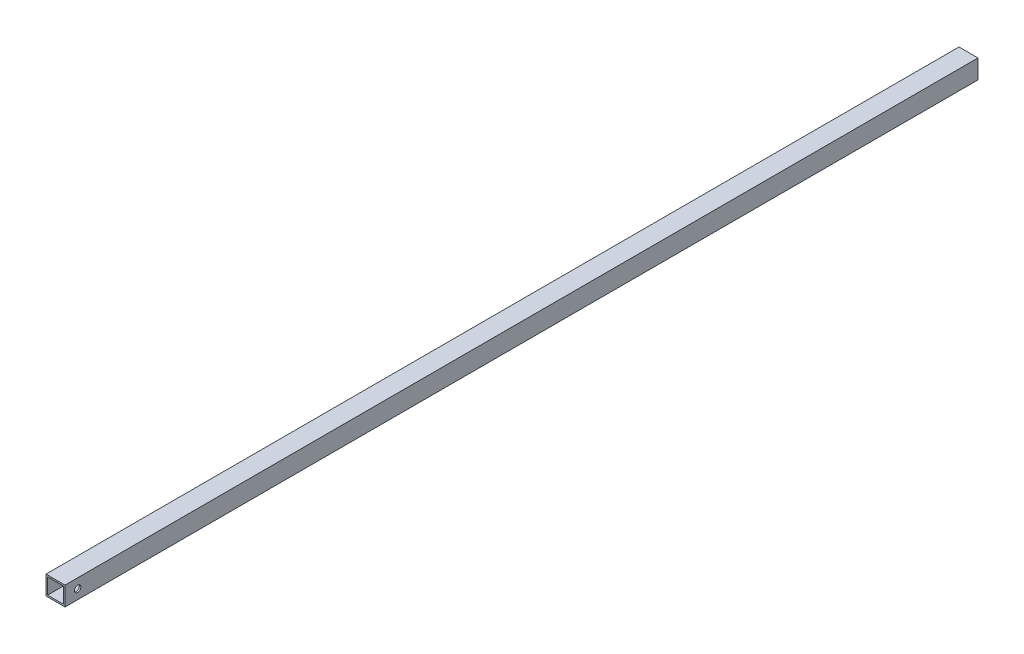
ISO-10303-21;
HEADER;
FILE_DESCRIPTION(('STEP AP214'),'2;1');
FILE_NAME('part.step','',(''),(''),'','','');
FILE_SCHEMA(('AUTOMOTIVE_DESIGN { 1 0 10303 214 1 1 1 1 }'));
ENDSEC;
DATA;
#1=APPLICATION_CONTEXT('core data for automotive mechanical design processes');
#2=APPLICATION_PROTOCOL_DEFINITION('international standard','automotive_design',2000,#1);
#3=PRODUCT_CONTEXT('',#1,'mechanical');
#4=PRODUCT('Part','Part','',(#3));
#5=PRODUCT_RELATED_PRODUCT_CATEGORY('part','',(#4));
#6=PRODUCT_DEFINITION_FORMATION('','',#4);
#7=PRODUCT_DEFINITION_CONTEXT('part definition',#1,'design');
#8=PRODUCT_DEFINITION('design','',#6,#7);
#9=PRODUCT_DEFINITION_SHAPE('','',#8);
#10=(LENGTH_UNIT() NAMED_UNIT(*) SI_UNIT(.MILLI.,.METRE.));
#11=(NAMED_UNIT(*) PLANE_ANGLE_UNIT() SI_UNIT($,.RADIAN.));
#12=(NAMED_UNIT(*) SI_UNIT($,.STERADIAN.) SOLID_ANGLE_UNIT());
#13=UNCERTAINTY_MEASURE_WITH_UNIT(LENGTH_MEASURE(1.E-05),#10,'distance_accuracy_value','');
#14=(GEOMETRIC_REPRESENTATION_CONTEXT(3) GLOBAL_UNCERTAINTY_ASSIGNED_CONTEXT((#13)) GLOBAL_UNIT_ASSIGNED_CONTEXT((#10,
#11,#12)) REPRESENTATION_CONTEXT('',''));
#15=CARTESIAN_POINT('',(0.,0.,0.));
#16=DIRECTION('',(0.,0.,1.));
#17=DIRECTION('',(1.,0.,0.));
#18=AXIS2_PLACEMENT_3D('',#15,#16,#17);
#19=CARTESIAN_POINT('',(19.05,19.05,-1828.8));
#20=DIRECTION('',(1.,0.,0.));
#21=DIRECTION('',(0.,1.,0.));
#22=AXIS2_PLACEMENT_3D('',#19,#20,#21);
#23=PLANE('',#22);
#24=CARTESIAN_POINT('',(19.05,0.,-25.4));
#25=DIRECTION('',(1.,0.,0.));
#26=DIRECTION('',(0.,1.,0.));
#27=AXIS2_PLACEMENT_3D('',#24,#25,#26);
#28=CIRCLE('',#27,6.35);
#29=CARTESIAN_POINT('',(19.05,6.35,-25.4));
#30=VERTEX_POINT('',#29);
#31=EDGE_CURVE('E196',#30,#30,#28,.F.);
#32=ORIENTED_EDGE('',*,*,#31,.T.);
#33=EDGE_LOOP('',(#32));
#34=FACE_BOUND('',#33,.T.);
#35=DIRECTION('',(0.,1.,0.));
#36=VECTOR('',#35,1.);
#37=CARTESIAN_POINT('',(19.05,19.05,0.));
#38=LINE('',#37,#36);
#39=CARTESIAN_POINT('',(19.05,-19.05,0.));
#40=VERTEX_POINT('',#39);
#41=CARTESIAN_POINT('',(19.05,19.05,0.));
#42=VERTEX_POINT('',#41);
#43=EDGE_CURVE('E134',#40,#42,#38,.T.);
#44=ORIENTED_EDGE('',*,*,#43,.F.);
#45=DIRECTION('',(0.,0.,1.));
#46=VECTOR('',#45,1.);
#47=CARTESIAN_POINT('',(19.05,-19.05,-1828.8));
#48=LINE('',#47,#46);
#49=CARTESIAN_POINT('',(19.05,-19.05,-1828.8));
#50=VERTEX_POINT('',#49);
#51=EDGE_CURVE('E11',#50,#40,#48,.T.);
#52=ORIENTED_EDGE('',*,*,#51,.F.);
#53=DIRECTION('',(0.,1.,0.));
#54=VECTOR('',#53,1.);
#55=CARTESIAN_POINT('',(19.05,19.05,-1828.8));
#56=LINE('',#55,#54);
#57=CARTESIAN_POINT('',(19.05,19.05,-1828.8));
#58=VERTEX_POINT('',#57);
#59=EDGE_CURVE('E138',#50,#58,#56,.T.);
#60=ORIENTED_EDGE('',*,*,#59,.T.);
#61=DIRECTION('',(0.,0.,1.));
#62=VECTOR('',#61,1.);
#63=CARTESIAN_POINT('',(19.05,19.05,-1828.8));
#64=LINE('',#63,#62);
#65=EDGE_CURVE('E151',#58,#42,#64,.T.);
#66=ORIENTED_EDGE('',*,*,#65,.T.);
#67=EDGE_LOOP('',(#44,#52,#60,#66));
#68=FACE_BOUND('',#67,.T.);
#69=ADVANCED_FACE('F33',(#34,#68),#23,.T.);
#70=CARTESIAN_POINT('',(-19.05,-19.05,-1828.8));
#71=DIRECTION('',(0.,-1.,0.));
#72=DIRECTION('',(0.,0.,-1.));
#73=AXIS2_PLACEMENT_3D('',#70,#71,#72);
#74=PLANE('',#73);
#75=DIRECTION('',(1.,0.,0.));
#76=VECTOR('',#75,1.);
#77=CARTESIAN_POINT('',(-19.05,-19.05,0.));
#78=LINE('',#77,#76);
#79=CARTESIAN_POINT('',(-19.05,-19.05,0.));
#80=VERTEX_POINT('',#79);
#81=EDGE_CURVE('E142',#80,#40,#78,.T.);
#82=ORIENTED_EDGE('',*,*,#81,.F.);
#83=DIRECTION('',(0.,0.,1.));
#84=VECTOR('',#83,1.);
#85=CARTESIAN_POINT('',(-19.05,-19.05,-1828.8));
#86=LINE('',#85,#84);
#87=CARTESIAN_POINT('',(-19.05,-19.05,-1828.8));
#88=VERTEX_POINT('',#87);
#89=EDGE_CURVE('E41',#88,#80,#86,.T.);
#90=ORIENTED_EDGE('',*,*,#89,.F.);
#91=DIRECTION('',(1.,0.,0.));
#92=VECTOR('',#91,1.);
#93=CARTESIAN_POINT('',(-19.05,-19.05,-1828.8));
#94=LINE('',#93,#92);
#95=EDGE_CURVE('E148',#88,#50,#94,.T.);
#96=ORIENTED_EDGE('',*,*,#95,.T.);
#97=ORIENTED_EDGE('',*,*,#51,.T.);
#98=EDGE_LOOP('',(#82,#90,#96,#97));
#99=FACE_BOUND('',#98,.T.);
#100=ADVANCED_FACE('F176',(#99),#74,.T.);
#101=CARTESIAN_POINT('',(-19.05,19.05,-1828.8));
#102=DIRECTION('',(-1.,0.,0.));
#103=DIRECTION('',(0.,-1.,0.));
#104=AXIS2_PLACEMENT_3D('',#101,#102,#103);
#105=PLANE('',#104);
#106=CARTESIAN_POINT('',(-19.05,0.,-25.4));
#107=DIRECTION('',(-1.,0.,0.));
#108=DIRECTION('',(0.,-1.,0.));
#109=AXIS2_PLACEMENT_3D('',#106,#107,#108);
#110=CIRCLE('',#109,6.35);
#111=CARTESIAN_POINT('',(-19.05,-6.35,-25.4));
#112=VERTEX_POINT('',#111);
#113=EDGE_CURVE('E198',#112,#112,#110,.T.);
#114=ORIENTED_EDGE('',*,*,#113,.F.);
#115=EDGE_LOOP('',(#114));
#116=FACE_BOUND('',#115,.T.);
#117=DIRECTION('',(0.,-1.,0.));
#118=VECTOR('',#117,1.);
#119=CARTESIAN_POINT('',(-19.05,19.05,0.));
#120=LINE('',#119,#118);
#121=CARTESIAN_POINT('',(-19.05,19.05,0.));
#122=VERTEX_POINT('',#121);
#123=EDGE_CURVE('E157',#122,#80,#120,.T.);
#124=ORIENTED_EDGE('',*,*,#123,.F.);
#125=DIRECTION('',(0.,0.,1.));
#126=VECTOR('',#125,1.);
#127=CARTESIAN_POINT('',(-19.05,19.05,-1828.8));
#128=LINE('',#127,#126);
#129=CARTESIAN_POINT('',(-19.05,19.05,-1828.8));
#130=VERTEX_POINT('',#129);
#131=EDGE_CURVE('E163',#130,#122,#128,.T.);
#132=ORIENTED_EDGE('',*,*,#131,.F.);
#133=DIRECTION('',(0.,-1.,0.));
#134=VECTOR('',#133,1.);
#135=CARTESIAN_POINT('',(-19.05,19.05,-1828.8));
#136=LINE('',#135,#134);
#137=EDGE_CURVE('E145',#130,#88,#136,.T.);
#138=ORIENTED_EDGE('',*,*,#137,.T.);
#139=ORIENTED_EDGE('',*,*,#89,.T.);
#140=EDGE_LOOP('',(#124,#132,#138,#139));
#141=FACE_BOUND('',#140,.T.);
#142=ADVANCED_FACE('F180',(#116,#141),#105,.T.);
#143=CARTESIAN_POINT('',(-19.05,19.05,-1828.8));
#144=DIRECTION('',(0.,1.,0.));
#145=DIRECTION('',(0.,0.,1.));
#146=AXIS2_PLACEMENT_3D('',#143,#144,#145);
#147=PLANE('',#146);
#148=DIRECTION('',(-1.,0.,0.));
#149=VECTOR('',#148,1.);
#150=CARTESIAN_POINT('',(-19.05,19.05,0.));
#151=LINE('',#150,#149);
#152=EDGE_CURVE('E154',#42,#122,#151,.T.);
#153=ORIENTED_EDGE('',*,*,#152,.F.);
#154=ORIENTED_EDGE('',*,*,#65,.F.);
#155=DIRECTION('',(-1.,0.,0.));
#156=VECTOR('',#155,1.);
#157=CARTESIAN_POINT('',(-19.05,19.05,-1828.8));
#158=LINE('',#157,#156);
#159=EDGE_CURVE('E141',#58,#130,#158,.T.);
#160=ORIENTED_EDGE('',*,*,#159,.T.);
#161=ORIENTED_EDGE('',*,*,#131,.T.);
#162=EDGE_LOOP('',(#153,#154,#160,#161));
#163=FACE_BOUND('',#162,.T.);
#164=ADVANCED_FACE('F170',(#163),#147,.T.);
#165=CARTESIAN_POINT('',(0.,0.,-1828.8));
#166=DIRECTION('',(0.,0.,1.));
#167=DIRECTION('',(1.,0.,0.));
#168=AXIS2_PLACEMENT_3D('',#165,#166,#167);
#169=PLANE('',#168);
#170=DIRECTION('',(0.,1.,0.));
#171=VECTOR('',#170,1.);
#172=CARTESIAN_POINT('',(15.875,15.875,-1828.8));
#173=LINE('',#172,#171);
#174=CARTESIAN_POINT('',(15.875,-15.875,-1828.8));
#175=VERTEX_POINT('',#174);
#176=CARTESIAN_POINT('',(15.875,15.875,-1828.8));
#177=VERTEX_POINT('',#176);
#178=EDGE_CURVE('E106',#175,#177,#173,.T.);
#179=ORIENTED_EDGE('',*,*,#178,.T.);
#180=DIRECTION('',(-1.,0.,0.));
#181=VECTOR('',#180,1.);
#182=CARTESIAN_POINT('',(-15.875,15.875,-1828.8));
#183=LINE('',#182,#181);
#184=CARTESIAN_POINT('',(-15.875,15.875,-1828.8));
#185=VERTEX_POINT('',#184);
#186=EDGE_CURVE('E100',#177,#185,#183,.T.);
#187=ORIENTED_EDGE('',*,*,#186,.T.);
#188=DIRECTION('',(0.,-1.,0.));
#189=VECTOR('',#188,1.);
#190=CARTESIAN_POINT('',(-15.875,15.875,-1828.8));
#191=LINE('',#190,#189);
#192=CARTESIAN_POINT('',(-15.875,-15.875,-1828.8));
#193=VERTEX_POINT('',#192);
#194=EDGE_CURVE('E109',#185,#193,#191,.T.);
#195=ORIENTED_EDGE('',*,*,#194,.T.);
#196=DIRECTION('',(1.,0.,0.));
#197=VECTOR('',#196,1.);
#198=CARTESIAN_POINT('',(-15.875,-15.875,-1828.8));
#199=LINE('',#198,#197);
#200=EDGE_CURVE('E49',#193,#175,#199,.T.);
#201=ORIENTED_EDGE('',*,*,#200,.T.);
#202=EDGE_LOOP('',(#179,#187,#195,#201));
#203=FACE_BOUND('',#202,.T.);
#204=ORIENTED_EDGE('',*,*,#59,.F.);
#205=ORIENTED_EDGE('',*,*,#95,.F.);
#206=ORIENTED_EDGE('',*,*,#137,.F.);
#207=ORIENTED_EDGE('',*,*,#159,.F.);
#208=EDGE_LOOP('',(#204,#205,#206,#207));
#209=FACE_BOUND('',#208,.T.);
#210=ADVANCED_FACE('F113',(#203,#209),#169,.F.);
#211=CARTESIAN_POINT('',(0.,0.,0.));
#212=DIRECTION('',(0.,0.,1.));
#213=DIRECTION('',(1.,0.,0.));
#214=AXIS2_PLACEMENT_3D('',#211,#212,#213);
#215=PLANE('',#214);
#216=DIRECTION('',(-1.,0.,0.));
#217=VECTOR('',#216,1.);
#218=CARTESIAN_POINT('',(-15.875,15.875,0.));
#219=LINE('',#218,#217);
#220=CARTESIAN_POINT('',(15.875,15.875,0.));
#221=VERTEX_POINT('',#220);
#222=CARTESIAN_POINT('',(-15.875,15.875,0.));
#223=VERTEX_POINT('',#222);
#224=EDGE_CURVE('E57',#221,#223,#219,.T.);
#225=ORIENTED_EDGE('',*,*,#224,.F.);
#226=DIRECTION('',(0.,1.,0.));
#227=VECTOR('',#226,1.);
#228=CARTESIAN_POINT('',(15.875,15.875,0.));
#229=LINE('',#228,#227);
#230=CARTESIAN_POINT('',(15.875,-15.875,0.));
#231=VERTEX_POINT('',#230);
#232=EDGE_CURVE('E116',#231,#221,#229,.T.);
#233=ORIENTED_EDGE('',*,*,#232,.F.);
#234=DIRECTION('',(1.,0.,0.));
#235=VECTOR('',#234,1.);
#236=CARTESIAN_POINT('',(-15.875,-15.875,0.));
#237=LINE('',#236,#235);
#238=CARTESIAN_POINT('',(-15.875,-15.875,0.));
#239=VERTEX_POINT('',#238);
#240=EDGE_CURVE('E119',#239,#231,#237,.T.);
#241=ORIENTED_EDGE('',*,*,#240,.F.);
#242=DIRECTION('',(0.,-1.,0.));
#243=VECTOR('',#242,1.);
#244=CARTESIAN_POINT('',(-15.875,15.875,0.));
#245=LINE('',#244,#243);
#246=EDGE_CURVE('E128',#223,#239,#245,.T.);
#247=ORIENTED_EDGE('',*,*,#246,.F.);
#248=EDGE_LOOP('',(#225,#233,#241,#247));
#249=FACE_BOUND('',#248,.T.);
#250=ORIENTED_EDGE('',*,*,#43,.T.);
#251=ORIENTED_EDGE('',*,*,#152,.T.);
#252=ORIENTED_EDGE('',*,*,#123,.T.);
#253=ORIENTED_EDGE('',*,*,#81,.T.);
#254=EDGE_LOOP('',(#250,#251,#252,#253));
#255=FACE_BOUND('',#254,.T.);
#256=ADVANCED_FACE('F173',(#249,#255),#215,.T.);
#257=CARTESIAN_POINT('',(-15.875,15.875,-1828.8));
#258=DIRECTION('',(0.,1.,0.));
#259=DIRECTION('',(0.,0.,1.));
#260=AXIS2_PLACEMENT_3D('',#257,#258,#259);
#261=PLANE('',#260);
#262=ORIENTED_EDGE('',*,*,#224,.T.);
#263=DIRECTION('',(0.,0.,1.));
#264=VECTOR('',#263,1.);
#265=CARTESIAN_POINT('',(-15.875,15.875,-1828.8));
#266=LINE('',#265,#264);
#267=EDGE_CURVE('E96',#185,#223,#266,.T.);
#268=ORIENTED_EDGE('',*,*,#267,.F.);
#269=ORIENTED_EDGE('',*,*,#186,.F.);
#270=DIRECTION('',(0.,0.,1.));
#271=VECTOR('',#270,1.);
#272=CARTESIAN_POINT('',(15.875,15.875,-1828.8));
#273=LINE('',#272,#271);
#274=EDGE_CURVE('E132',#177,#221,#273,.T.);
#275=ORIENTED_EDGE('',*,*,#274,.T.);
#276=EDGE_LOOP('',(#262,#268,#269,#275));
#277=FACE_BOUND('',#276,.T.);
#278=ADVANCED_FACE('F98',(#277),#261,.F.);
#279=CARTESIAN_POINT('',(15.875,15.875,-1828.8));
#280=DIRECTION('',(1.,0.,0.));
#281=DIRECTION('',(0.,1.,0.));
#282=AXIS2_PLACEMENT_3D('',#279,#280,#281);
#283=PLANE('',#282);
#284=CARTESIAN_POINT('',(15.875,0.,-25.4));
#285=DIRECTION('',(1.,0.,0.));
#286=DIRECTION('',(0.,1.,0.));
#287=AXIS2_PLACEMENT_3D('',#284,#285,#286);
#288=CIRCLE('',#287,6.35);
#289=CARTESIAN_POINT('',(15.875,6.35,-25.4));
#290=VERTEX_POINT('',#289);
#291=EDGE_CURVE('E122',#290,#290,#288,.T.);
#292=ORIENTED_EDGE('',*,*,#291,.T.);
#293=EDGE_LOOP('',(#292));
#294=FACE_BOUND('',#293,.T.);
#295=ORIENTED_EDGE('',*,*,#232,.T.);
#296=ORIENTED_EDGE('',*,*,#274,.F.);
#297=ORIENTED_EDGE('',*,*,#178,.F.);
#298=DIRECTION('',(0.,0.,1.));
#299=VECTOR('',#298,1.);
#300=CARTESIAN_POINT('',(15.875,-15.875,-1828.8));
#301=LINE('',#300,#299);
#302=EDGE_CURVE('E135',#175,#231,#301,.T.);
#303=ORIENTED_EDGE('',*,*,#302,.T.);
#304=EDGE_LOOP('',(#295,#296,#297,#303));
#305=FACE_BOUND('',#304,.T.);
#306=ADVANCED_FACE('F216',(#294,#305),#283,.F.);
#307=CARTESIAN_POINT('',(-15.875,-15.875,-1828.8));
#308=DIRECTION('',(0.,-1.,0.));
#309=DIRECTION('',(1.,0.,0.));
#310=AXIS2_PLACEMENT_3D('',#307,#308,#309);
#311=PLANE('',#310);
#312=ORIENTED_EDGE('',*,*,#240,.T.);
#313=ORIENTED_EDGE('',*,*,#302,.F.);
#314=ORIENTED_EDGE('',*,*,#200,.F.);
#315=DIRECTION('',(0.,0.,1.));
#316=VECTOR('',#315,1.);
#317=CARTESIAN_POINT('',(-15.875,-15.875,-1828.8));
#318=LINE('',#317,#316);
#319=EDGE_CURVE('E105',#193,#239,#318,.T.);
#320=ORIENTED_EDGE('',*,*,#319,.T.);
#321=EDGE_LOOP('',(#312,#313,#314,#320));
#322=FACE_BOUND('',#321,.T.);
#323=ADVANCED_FACE('F211',(#322),#311,.F.);
#324=CARTESIAN_POINT('',(-15.875,15.875,-1828.8));
#325=DIRECTION('',(-1.,0.,0.));
#326=DIRECTION('',(0.,-1.,0.));
#327=AXIS2_PLACEMENT_3D('',#324,#325,#326);
#328=PLANE('',#327);
#329=CARTESIAN_POINT('',(-15.875,0.,-25.4));
#330=DIRECTION('',(-1.,0.,0.));
#331=DIRECTION('',(0.,-1.,0.));
#332=AXIS2_PLACEMENT_3D('',#329,#330,#331);
#333=CIRCLE('',#332,6.35);
#334=CARTESIAN_POINT('',(-15.875,-6.35,-25.4));
#335=VERTEX_POINT('',#334);
#336=EDGE_CURVE('E36',#335,#335,#333,.T.);
#337=ORIENTED_EDGE('',*,*,#336,.T.);
#338=EDGE_LOOP('',(#337));
#339=FACE_BOUND('',#338,.T.);
#340=ORIENTED_EDGE('',*,*,#246,.T.);
#341=ORIENTED_EDGE('',*,*,#319,.F.);
#342=ORIENTED_EDGE('',*,*,#194,.F.);
#343=ORIENTED_EDGE('',*,*,#267,.T.);
#344=EDGE_LOOP('',(#340,#341,#342,#343));
#345=FACE_BOUND('',#344,.T.);
#346=ADVANCED_FACE('F110',(#339,#345),#328,.F.);
#347=CARTESIAN_POINT('',(37.0105122421383,0.,-25.4));
#348=DIRECTION('',(-1.,0.,0.));
#349=DIRECTION('',(0.,-1.,0.));
#350=AXIS2_PLACEMENT_3D('',#347,#348,#349);
#351=CYLINDRICAL_SURFACE('',#350,6.35);
#352=ORIENTED_EDGE('',*,*,#113,.T.);
#353=EDGE_LOOP('',(#352));
#354=FACE_BOUND('',#353,.T.);
#355=ORIENTED_EDGE('',*,*,#336,.F.);
#356=EDGE_LOOP('',(#355));
#357=FACE_BOUND('',#356,.T.);
#358=ADVANCED_FACE('F203',(#354,#357),#351,.F.);
#359=ORIENTED_EDGE('',*,*,#31,.F.);
#360=EDGE_LOOP('',(#359));
#361=FACE_BOUND('',#360,.T.);
#362=ORIENTED_EDGE('',*,*,#291,.F.);
#363=EDGE_LOOP('',(#362));
#364=FACE_BOUND('',#363,.T.);
#365=ADVANCED_FACE('F206',(#361,#364),#351,.F.);
#366=CLOSED_SHELL('',(#69,#100,#142,#164,#210,#256,#278,#306,#323,#346,#358,#365));
#367=MANIFOLD_SOLID_BREP('B2',#366);
#368=ADVANCED_BREP_SHAPE_REPRESENTATION('',(#18,#367),#14);
#369=SHAPE_DEFINITION_REPRESENTATION(#9,#368);
ENDSEC;
END-ISO-10303-21;
